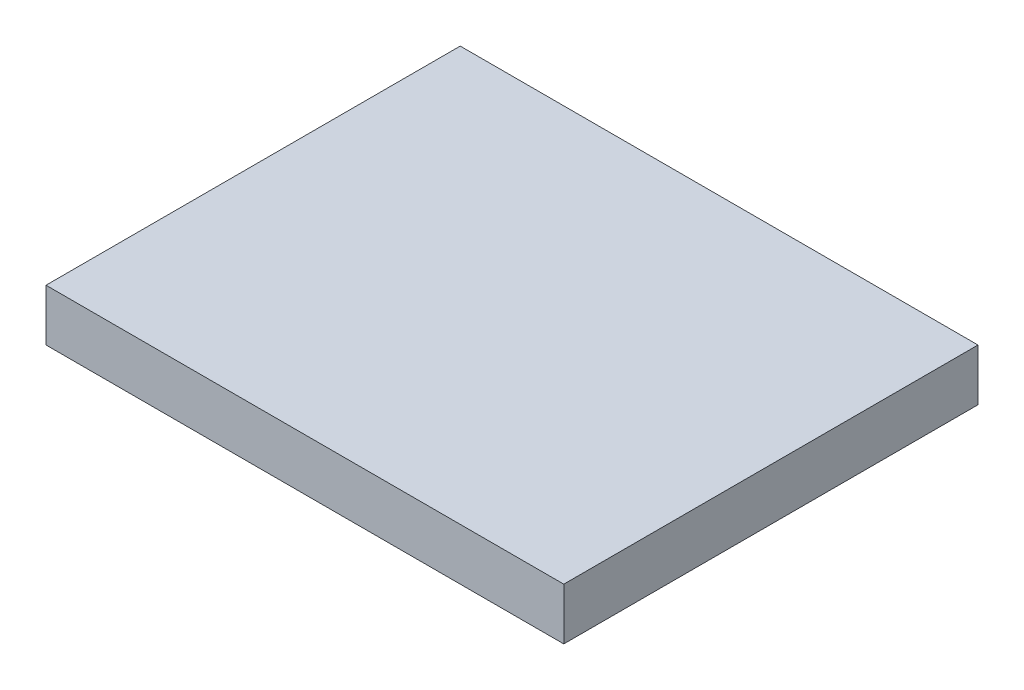
ISO-10303-21;
HEADER;
FILE_DESCRIPTION(('STEP AP214'),'2;1');
FILE_NAME('part.step','',(''),(''),'','','');
FILE_SCHEMA(('AUTOMOTIVE_DESIGN { 1 0 10303 214 1 1 1 1 }'));
ENDSEC;
DATA;
#1=APPLICATION_CONTEXT('core data for automotive mechanical design processes');
#2=APPLICATION_PROTOCOL_DEFINITION('international standard','automotive_design',2000,#1);
#3=PRODUCT_CONTEXT('',#1,'mechanical');
#4=PRODUCT('Part','Part','',(#3));
#5=PRODUCT_RELATED_PRODUCT_CATEGORY('part','',(#4));
#6=PRODUCT_DEFINITION_FORMATION('','',#4);
#7=PRODUCT_DEFINITION_CONTEXT('part definition',#1,'design');
#8=PRODUCT_DEFINITION('design','',#6,#7);
#9=PRODUCT_DEFINITION_SHAPE('','',#8);
#10=(LENGTH_UNIT() NAMED_UNIT(*) SI_UNIT(.MILLI.,.METRE.));
#11=(NAMED_UNIT(*) PLANE_ANGLE_UNIT() SI_UNIT($,.RADIAN.));
#12=(NAMED_UNIT(*) SI_UNIT($,.STERADIAN.) SOLID_ANGLE_UNIT());
#13=UNCERTAINTY_MEASURE_WITH_UNIT(LENGTH_MEASURE(1.E-05),#10,'distance_accuracy_value','');
#14=(GEOMETRIC_REPRESENTATION_CONTEXT(3) GLOBAL_UNCERTAINTY_ASSIGNED_CONTEXT((#13)) GLOBAL_UNIT_ASSIGNED_CONTEXT((#10,
#11,#12)) REPRESENTATION_CONTEXT('',''));
#15=CARTESIAN_POINT('',(0.,0.,0.));
#16=DIRECTION('',(0.,0.,1.));
#17=DIRECTION('',(1.,0.,0.));
#18=AXIS2_PLACEMENT_3D('',#15,#16,#17);
#19=CARTESIAN_POINT('',(0.,10.,0.));
#20=DIRECTION('',(1.,0.,0.));
#21=DIRECTION('',(0.,0.,-1.));
#22=AXIS2_PLACEMENT_3D('',#19,#20,#21);
#23=PLANE('',#22);
#24=DIRECTION('',(0.,0.,1.));
#25=VECTOR('',#24,1.);
#26=CARTESIAN_POINT('',(0.,0.,0.));
#27=LINE('',#26,#25);
#28=CARTESIAN_POINT('',(0.,0.,0.));
#29=VERTEX_POINT('',#28);
#30=CARTESIAN_POINT('',(0.,0.,80.));
#31=VERTEX_POINT('',#30);
#32=EDGE_CURVE('E107',#29,#31,#27,.T.);
#33=ORIENTED_EDGE('',*,*,#32,.T.);
#34=DIRECTION('',(0.,-1.,0.));
#35=VECTOR('',#34,1.);
#36=CARTESIAN_POINT('',(0.,10.,80.));
#37=LINE('',#36,#35);
#38=CARTESIAN_POINT('',(0.,10.,80.));
#39=VERTEX_POINT('',#38);
#40=EDGE_CURVE('E11',#39,#31,#37,.T.);
#41=ORIENTED_EDGE('',*,*,#40,.F.);
#42=DIRECTION('',(0.,0.,1.));
#43=VECTOR('',#42,1.);
#44=CARTESIAN_POINT('',(0.,10.,0.));
#45=LINE('',#44,#43);
#46=CARTESIAN_POINT('',(0.,10.,0.));
#47=VERTEX_POINT('',#46);
#48=EDGE_CURVE('E91',#47,#39,#45,.T.);
#49=ORIENTED_EDGE('',*,*,#48,.F.);
#50=DIRECTION('',(0.,-1.,0.));
#51=VECTOR('',#50,1.);
#52=CARTESIAN_POINT('',(0.,10.,0.));
#53=LINE('',#52,#51);
#54=EDGE_CURVE('E103',#47,#29,#53,.T.);
#55=ORIENTED_EDGE('',*,*,#54,.T.);
#56=EDGE_LOOP('',(#33,#41,#49,#55));
#57=FACE_BOUND('',#56,.T.);
#58=ADVANCED_FACE('F39',(#57),#23,.F.);
#59=CARTESIAN_POINT('',(0.,10.,80.));
#60=DIRECTION('',(0.,0.,-1.));
#61=DIRECTION('',(-1.,0.,0.));
#62=AXIS2_PLACEMENT_3D('',#59,#60,#61);
#63=PLANE('',#62);
#64=DIRECTION('',(1.,0.,0.));
#65=VECTOR('',#64,1.);
#66=CARTESIAN_POINT('',(0.,0.,80.));
#67=LINE('',#66,#65);
#68=CARTESIAN_POINT('',(100.,0.,80.));
#69=VERTEX_POINT('',#68);
#70=EDGE_CURVE('E96',#31,#69,#67,.T.);
#71=ORIENTED_EDGE('',*,*,#70,.T.);
#72=DIRECTION('',(0.,-1.,0.));
#73=VECTOR('',#72,1.);
#74=CARTESIAN_POINT('',(100.,10.,80.));
#75=LINE('',#74,#73);
#76=CARTESIAN_POINT('',(100.,10.,80.));
#77=VERTEX_POINT('',#76);
#78=EDGE_CURVE('E48',#77,#69,#75,.T.);
#79=ORIENTED_EDGE('',*,*,#78,.F.);
#80=DIRECTION('',(1.,0.,0.));
#81=VECTOR('',#80,1.);
#82=CARTESIAN_POINT('',(0.,10.,80.));
#83=LINE('',#82,#81);
#84=EDGE_CURVE('E86',#39,#77,#83,.T.);
#85=ORIENTED_EDGE('',*,*,#84,.F.);
#86=ORIENTED_EDGE('',*,*,#40,.T.);
#87=EDGE_LOOP('',(#71,#79,#85,#86));
#88=FACE_BOUND('',#87,.T.);
#89=ADVANCED_FACE('F95',(#88),#63,.F.);
#90=CARTESIAN_POINT('',(100.,10.,0.));
#91=DIRECTION('',(-1.,0.,0.));
#92=DIRECTION('',(0.,0.,1.));
#93=AXIS2_PLACEMENT_3D('',#90,#91,#92);
#94=PLANE('',#93);
#95=DIRECTION('',(0.,0.,-1.));
#96=VECTOR('',#95,1.);
#97=CARTESIAN_POINT('',(100.,0.,0.));
#98=LINE('',#97,#96);
#99=CARTESIAN_POINT('',(100.,0.,0.));
#100=VERTEX_POINT('',#99);
#101=EDGE_CURVE('E73',#69,#100,#98,.T.);
#102=ORIENTED_EDGE('',*,*,#101,.T.);
#103=DIRECTION('',(0.,-1.,0.));
#104=VECTOR('',#103,1.);
#105=CARTESIAN_POINT('',(100.,10.,0.));
#106=LINE('',#105,#104);
#107=CARTESIAN_POINT('',(100.,10.,0.));
#108=VERTEX_POINT('',#107);
#109=EDGE_CURVE('E98',#108,#100,#106,.T.);
#110=ORIENTED_EDGE('',*,*,#109,.F.);
#111=DIRECTION('',(0.,0.,-1.));
#112=VECTOR('',#111,1.);
#113=CARTESIAN_POINT('',(100.,10.,0.));
#114=LINE('',#113,#112);
#115=EDGE_CURVE('E89',#77,#108,#114,.T.);
#116=ORIENTED_EDGE('',*,*,#115,.F.);
#117=ORIENTED_EDGE('',*,*,#78,.T.);
#118=EDGE_LOOP('',(#102,#110,#116,#117));
#119=FACE_BOUND('',#118,.T.);
#120=ADVANCED_FACE('F99',(#119),#94,.F.);
#121=CARTESIAN_POINT('',(0.,10.,0.));
#122=DIRECTION('',(0.,0.,1.));
#123=DIRECTION('',(1.,0.,0.));
#124=AXIS2_PLACEMENT_3D('',#121,#122,#123);
#125=PLANE('',#124);
#126=DIRECTION('',(-1.,0.,0.));
#127=VECTOR('',#126,1.);
#128=CARTESIAN_POINT('',(0.,0.,0.));
#129=LINE('',#128,#127);
#130=EDGE_CURVE('E79',#100,#29,#129,.T.);
#131=ORIENTED_EDGE('',*,*,#130,.T.);
#132=ORIENTED_EDGE('',*,*,#54,.F.);
#133=DIRECTION('',(-1.,0.,0.));
#134=VECTOR('',#133,1.);
#135=CARTESIAN_POINT('',(0.,10.,0.));
#136=LINE('',#135,#134);
#137=EDGE_CURVE('E56',#108,#47,#136,.T.);
#138=ORIENTED_EDGE('',*,*,#137,.F.);
#139=ORIENTED_EDGE('',*,*,#109,.T.);
#140=EDGE_LOOP('',(#131,#132,#138,#139));
#141=FACE_BOUND('',#140,.T.);
#142=ADVANCED_FACE('F120',(#141),#125,.F.);
#143=CARTESIAN_POINT('',(0.,10.,0.));
#144=DIRECTION('',(0.,1.,0.));
#145=DIRECTION('',(0.,0.,1.));
#146=AXIS2_PLACEMENT_3D('',#143,#144,#145);
#147=PLANE('',#146);
#148=ORIENTED_EDGE('',*,*,#48,.T.);
#149=ORIENTED_EDGE('',*,*,#84,.T.);
#150=ORIENTED_EDGE('',*,*,#115,.T.);
#151=ORIENTED_EDGE('',*,*,#137,.T.);
#152=EDGE_LOOP('',(#148,#149,#150,#151));
#153=FACE_BOUND('',#152,.T.);
#154=ADVANCED_FACE('F87',(#153),#147,.T.);
#155=CARTESIAN_POINT('',(0.,0.,0.));
#156=DIRECTION('',(0.,1.,0.));
#157=DIRECTION('',(0.,0.,1.));
#158=AXIS2_PLACEMENT_3D('',#155,#156,#157);
#159=PLANE('',#158);
#160=ORIENTED_EDGE('',*,*,#32,.F.);
#161=ORIENTED_EDGE('',*,*,#130,.F.);
#162=ORIENTED_EDGE('',*,*,#101,.F.);
#163=ORIENTED_EDGE('',*,*,#70,.F.);
#164=EDGE_LOOP('',(#160,#161,#162,#163));
#165=FACE_BOUND('',#164,.T.);
#166=ADVANCED_FACE('F123',(#165),#159,.F.);
#167=CLOSED_SHELL('',(#58,#89,#120,#142,#154,#166));
#168=MANIFOLD_SOLID_BREP('B2',#167);
#169=ADVANCED_BREP_SHAPE_REPRESENTATION('',(#18,#168),#14);
#170=SHAPE_DEFINITION_REPRESENTATION(#9,#169);
ENDSEC;
END-ISO-10303-21;
